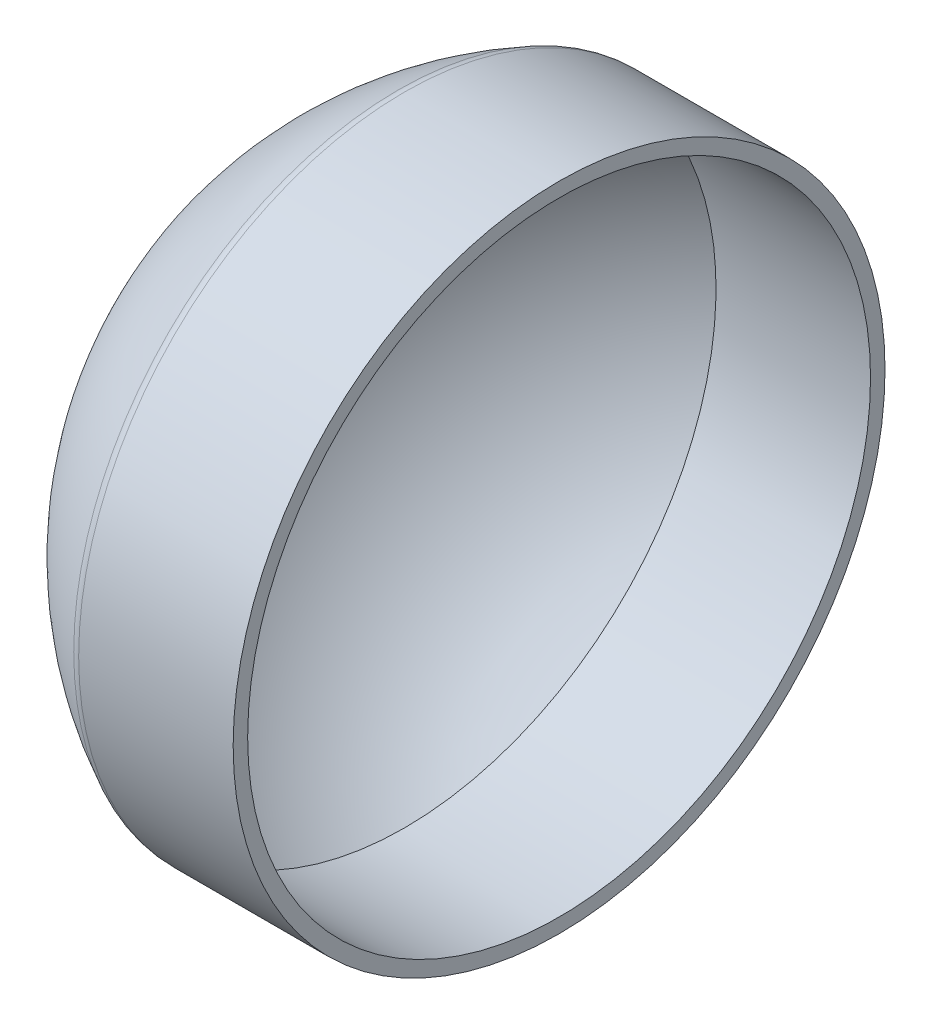
ISO-10303-21;
HEADER;
FILE_DESCRIPTION(('STEP AP214'),'2;1');
FILE_NAME('part.step','',(''),(''),'','','');
FILE_SCHEMA(('AUTOMOTIVE_DESIGN { 1 0 10303 214 1 1 1 1 }'));
ENDSEC;
DATA;
#1=APPLICATION_CONTEXT('core data for automotive mechanical design processes');
#2=APPLICATION_PROTOCOL_DEFINITION('international standard','automotive_design',2000,#1);
#3=PRODUCT_CONTEXT('',#1,'mechanical');
#4=PRODUCT('Part','Part','',(#3));
#5=PRODUCT_RELATED_PRODUCT_CATEGORY('part','',(#4));
#6=PRODUCT_DEFINITION_FORMATION('','',#4);
#7=PRODUCT_DEFINITION_CONTEXT('part definition',#1,'design');
#8=PRODUCT_DEFINITION('design','',#6,#7);
#9=PRODUCT_DEFINITION_SHAPE('','',#8);
#10=(LENGTH_UNIT() NAMED_UNIT(*) SI_UNIT(.MILLI.,.METRE.));
#11=(NAMED_UNIT(*) PLANE_ANGLE_UNIT() SI_UNIT($,.RADIAN.));
#12=(NAMED_UNIT(*) SI_UNIT($,.STERADIAN.) SOLID_ANGLE_UNIT());
#13=UNCERTAINTY_MEASURE_WITH_UNIT(LENGTH_MEASURE(1.E-05),#10,'distance_accuracy_value','');
#14=(GEOMETRIC_REPRESENTATION_CONTEXT(3) GLOBAL_UNCERTAINTY_ASSIGNED_CONTEXT((#13)) GLOBAL_UNIT_ASSIGNED_CONTEXT((#10,
#11,#12)) REPRESENTATION_CONTEXT('',''));
#15=CARTESIAN_POINT('',(0.,0.,0.));
#16=DIRECTION('',(0.,0.,1.));
#17=DIRECTION('',(1.,0.,0.));
#18=AXIS2_PLACEMENT_3D('',#15,#16,#17);
#19=CARTESIAN_POINT('',(317.50063500127,1.16647840914467E-13,0.));
#20=DIRECTION('',(-1.,0.,0.));
#21=DIRECTION('',(0.,-1.,0.));
#22=AXIS2_PLACEMENT_3D('',#19,#20,#21);
#23=SPHERICAL_SURFACE('',#22,609.601219202439);
#24=CARTESIAN_POINT('',(46.5998348018598,0.,0.));
#25=DIRECTION('',(-1.,0.,0.));
#26=DIRECTION('',(0.,0.,1.));
#27=AXIS2_PLACEMENT_3D('',#24,#25,#26);
#28=CIRCLE('',#27,546.101092202185);
#29=CARTESIAN_POINT('',(46.5998348018598,0.,546.101092202185));
#30=VERTEX_POINT('',#29);
#31=EDGE_CURVE('E44',#30,#30,#28,.T.);
#32=ORIENTED_EDGE('',*,*,#31,.F.);
#33=EDGE_LOOP('',(#32));
#34=FACE_BOUND('',#33,.T.);
#35=ADVANCED_FACE('F33',(#34),#23,.F.);
#36=CARTESIAN_POINT('',(-317.50063500127,0.,0.));
#37=DIRECTION('',(-1.,0.,0.));
#38=DIRECTION('',(0.,0.,1.));
#39=AXIS2_PLACEMENT_3D('',#36,#37,#38);
#40=CYLINDRICAL_SURFACE('',#39,546.101092202185);
#41=CARTESIAN_POINT('',(317.50063500127,0.,0.));
#42=DIRECTION('',(-1.,0.,0.));
#43=DIRECTION('',(0.,0.,1.));
#44=AXIS2_PLACEMENT_3D('',#41,#42,#43);
#45=CIRCLE('',#44,546.101092202185);
#46=CARTESIAN_POINT('',(317.50063500127,0.,546.101092202185));
#47=VERTEX_POINT('',#46);
#48=EDGE_CURVE('E48',#47,#47,#45,.T.);
#49=ORIENTED_EDGE('',*,*,#48,.F.);
#50=EDGE_LOOP('',(#49));
#51=FACE_BOUND('',#50,.T.);
#52=ORIENTED_EDGE('',*,*,#31,.T.);
#53=EDGE_LOOP('',(#52));
#54=FACE_BOUND('',#53,.T.);
#55=ADVANCED_FACE('F62',(#51,#54),#40,.F.);
#56=CARTESIAN_POINT('',(317.50063500127,571.501143002286,0.));
#57=DIRECTION('',(-1.,0.,0.));
#58=DIRECTION('',(0.,0.,1.));
#59=AXIS2_PLACEMENT_3D('',#56,#57,#58);
#60=PLANE('',#59);
#61=CARTESIAN_POINT('',(317.50063500127,0.,0.));
#62=DIRECTION('',(-1.,0.,0.));
#63=DIRECTION('',(0.,0.,1.));
#64=AXIS2_PLACEMENT_3D('',#61,#62,#63);
#65=CIRCLE('',#64,571.501143002286);
#66=CARTESIAN_POINT('',(317.50063500127,0.,571.501143002286));
#67=VERTEX_POINT('',#66);
#68=EDGE_CURVE('E53',#67,#67,#65,.T.);
#69=ORIENTED_EDGE('',*,*,#68,.F.);
#70=EDGE_LOOP('',(#69));
#71=FACE_BOUND('',#70,.T.);
#72=ORIENTED_EDGE('',*,*,#48,.T.);
#73=EDGE_LOOP('',(#72));
#74=FACE_BOUND('',#73,.T.);
#75=ADVANCED_FACE('F59',(#71,#74),#60,.F.);
#76=CARTESIAN_POINT('',(-317.50063500127,0.,0.));
#77=DIRECTION('',(-1.,0.,0.));
#78=DIRECTION('',(0.,0.,1.));
#79=AXIS2_PLACEMENT_3D('',#76,#77,#78);
#80=CYLINDRICAL_SURFACE('',#79,571.501143002286);
#81=CARTESIAN_POINT('',(46.5998228941328,0.,0.));
#82=DIRECTION('',(1.,0.,0.));
#83=DIRECTION('',(0.,0.,-1.));
#84=AXIS2_PLACEMENT_3D('',#81,#82,#83);
#85=CIRCLE('',#84,571.501143002286);
#86=CARTESIAN_POINT('',(46.5998228941328,0.,-571.501143002286));
#87=VERTEX_POINT('',#86);
#88=EDGE_CURVE('E10',#87,#87,#85,.T.);
#89=ORIENTED_EDGE('',*,*,#88,.T.);
#90=EDGE_LOOP('',(#89));
#91=FACE_BOUND('',#90,.T.);
#92=ORIENTED_EDGE('',*,*,#68,.T.);
#93=EDGE_LOOP('',(#92));
#94=FACE_BOUND('',#93,.T.);
#95=ADVANCED_FACE('F57',(#91,#94),#80,.T.);
#96=CARTESIAN_POINT('',(317.50063500127,1.16647840914467E-13,0.));
#97=DIRECTION('',(-1.,0.,0.));
#98=DIRECTION('',(0.,1.,0.));
#99=AXIS2_PLACEMENT_3D('',#96,#97,#98);
#100=SPHERICAL_SURFACE('',#99,635.00127000254);
#101=CARTESIAN_POINT('',(35.3123125720289,1.16647840914467E-13,0.));
#102=DIRECTION('',(1.,0.,0.));
#103=DIRECTION('',(0.,0.,-1.));
#104=AXIS2_PLACEMENT_3D('',#101,#102,#103);
#105=CIRCLE('',#104,568.855309889439);
#106=CARTESIAN_POINT('',(35.3123125720289,1.16647840914467E-13,-568.855309889439));
#107=VERTEX_POINT('',#106);
#108=EDGE_CURVE('E40',#107,#107,#105,.F.);
#109=ORIENTED_EDGE('',*,*,#108,.T.);
#110=EDGE_LOOP('',(#109));
#111=FACE_BOUND('',#110,.T.);
#112=ADVANCED_FACE('F77',(#111),#100,.T.);
#113=CARTESIAN_POINT('',(46.5998228941328,0.,0.));
#114=DIRECTION('',(1.,0.,0.));
#115=DIRECTION('',(0.,0.,-1.));
#116=AXIS2_PLACEMENT_3D('',#113,#114,#115);
#117=TOROIDAL_SURFACE('',#116,546.101143002286,25.4);
#118=ORIENTED_EDGE('',*,*,#88,.F.);
#119=EDGE_LOOP('',(#118));
#120=FACE_BOUND('',#119,.T.);
#121=ORIENTED_EDGE('',*,*,#108,.F.);
#122=EDGE_LOOP('',(#121));
#123=FACE_BOUND('',#122,.T.);
#124=ADVANCED_FACE('F35',(#120,#123),#117,.T.);
#125=CLOSED_SHELL('',(#35,#55,#75,#95,#112,#124));
#126=MANIFOLD_SOLID_BREP('B2',#125);
#127=ADVANCED_BREP_SHAPE_REPRESENTATION('',(#18,#126),#14);
#128=SHAPE_DEFINITION_REPRESENTATION(#9,#127);
ENDSEC;
END-ISO-10303-21;
